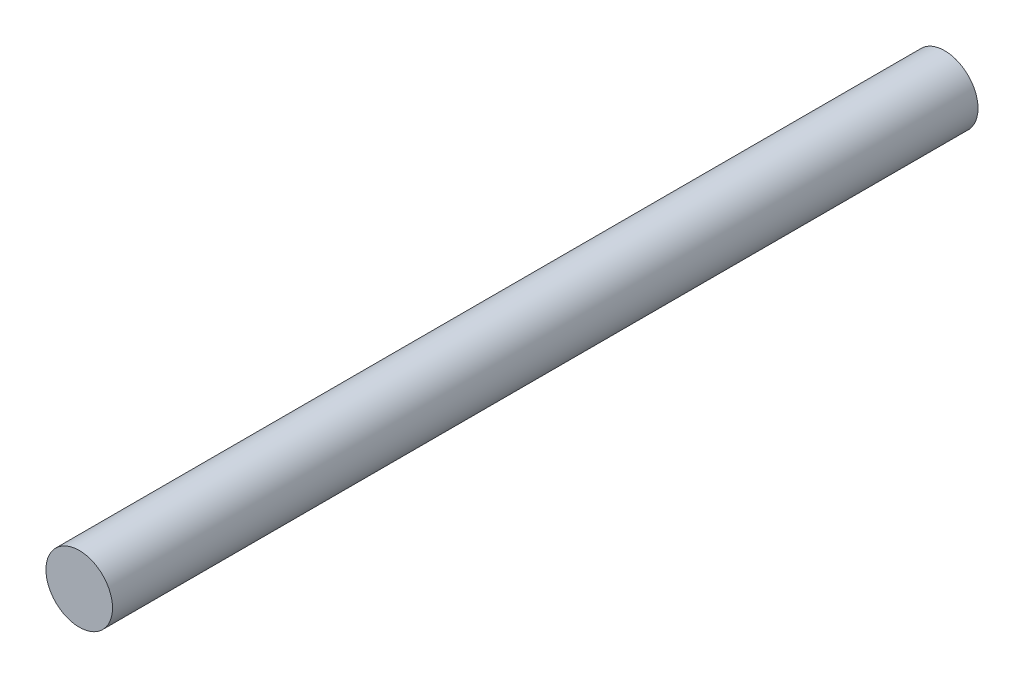
ISO-10303-21;
HEADER;
FILE_DESCRIPTION(('STEP AP214'),'2;1');
FILE_NAME('part.step','',(''),(''),'','','');
FILE_SCHEMA(('AUTOMOTIVE_DESIGN { 1 0 10303 214 1 1 1 1 }'));
ENDSEC;
DATA;
#1=APPLICATION_CONTEXT('core data for automotive mechanical design processes');
#2=APPLICATION_PROTOCOL_DEFINITION('international standard','automotive_design',2000,#1);
#3=PRODUCT_CONTEXT('',#1,'mechanical');
#4=PRODUCT('Part','Part','',(#3));
#5=PRODUCT_RELATED_PRODUCT_CATEGORY('part','',(#4));
#6=PRODUCT_DEFINITION_FORMATION('','',#4);
#7=PRODUCT_DEFINITION_CONTEXT('part definition',#1,'design');
#8=PRODUCT_DEFINITION('design','',#6,#7);
#9=PRODUCT_DEFINITION_SHAPE('','',#8);
#10=(LENGTH_UNIT() NAMED_UNIT(*) SI_UNIT(.MILLI.,.METRE.));
#11=(NAMED_UNIT(*) PLANE_ANGLE_UNIT() SI_UNIT($,.RADIAN.));
#12=(NAMED_UNIT(*) SI_UNIT($,.STERADIAN.) SOLID_ANGLE_UNIT());
#13=UNCERTAINTY_MEASURE_WITH_UNIT(LENGTH_MEASURE(1.E-05),#10,'distance_accuracy_value','');
#14=(GEOMETRIC_REPRESENTATION_CONTEXT(3) GLOBAL_UNCERTAINTY_ASSIGNED_CONTEXT((#13)) GLOBAL_UNIT_ASSIGNED_CONTEXT((#10,
#11,#12)) REPRESENTATION_CONTEXT('',''));
#15=CARTESIAN_POINT('',(0.,0.,0.));
#16=DIRECTION('',(0.,0.,1.));
#17=DIRECTION('',(1.,0.,0.));
#18=AXIS2_PLACEMENT_3D('',#15,#16,#17);
#19=CARTESIAN_POINT('',(0.,0.,82.55));
#20=DIRECTION('',(0.,0.,-1.));
#21=DIRECTION('',(-1.,0.,0.));
#22=AXIS2_PLACEMENT_3D('',#19,#20,#21);
#23=CYLINDRICAL_SURFACE('',#22,6.35);
#24=CARTESIAN_POINT('',(0.,0.,82.55));
#25=DIRECTION('',(0.,0.,1.));
#26=DIRECTION('',(1.,0.,0.));
#27=AXIS2_PLACEMENT_3D('',#24,#25,#26);
#28=CIRCLE('',#27,6.35);
#29=CARTESIAN_POINT('',(6.35,0.,82.55));
#30=VERTEX_POINT('',#29);
#31=EDGE_CURVE('E10',#30,#30,#28,.T.);
#32=ORIENTED_EDGE('',*,*,#31,.F.);
#33=EDGE_LOOP('',(#32));
#34=FACE_BOUND('',#33,.T.);
#35=CARTESIAN_POINT('',(0.,0.,-82.55));
#36=DIRECTION('',(0.,0.,1.));
#37=DIRECTION('',(1.,0.,0.));
#38=AXIS2_PLACEMENT_3D('',#35,#36,#37);
#39=CIRCLE('',#38,6.35);
#40=CARTESIAN_POINT('',(6.35,0.,-82.55));
#41=VERTEX_POINT('',#40);
#42=EDGE_CURVE('E37',#41,#41,#39,.T.);
#43=ORIENTED_EDGE('',*,*,#42,.T.);
#44=EDGE_LOOP('',(#43));
#45=FACE_BOUND('',#44,.T.);
#46=ADVANCED_FACE('F34',(#34,#45),#23,.T.);
#47=CARTESIAN_POINT('',(0.,0.,82.55));
#48=DIRECTION('',(0.,0.,1.));
#49=DIRECTION('',(1.,0.,0.));
#50=AXIS2_PLACEMENT_3D('',#47,#48,#49);
#51=PLANE('',#50);
#52=ORIENTED_EDGE('',*,*,#31,.T.);
#53=EDGE_LOOP('',(#52));
#54=FACE_BOUND('',#53,.T.);
#55=ADVANCED_FACE('F49',(#54),#51,.T.);
#56=CARTESIAN_POINT('',(0.,0.,-82.55));
#57=DIRECTION('',(0.,0.,1.));
#58=DIRECTION('',(1.,0.,0.));
#59=AXIS2_PLACEMENT_3D('',#56,#57,#58);
#60=PLANE('',#59);
#61=ORIENTED_EDGE('',*,*,#42,.F.);
#62=EDGE_LOOP('',(#61));
#63=FACE_BOUND('',#62,.T.);
#64=ADVANCED_FACE('F47',(#63),#60,.F.);
#65=CLOSED_SHELL('',(#46,#55,#64));
#66=MANIFOLD_SOLID_BREP('B2',#65);
#67=ADVANCED_BREP_SHAPE_REPRESENTATION('',(#18,#66),#14);
#68=SHAPE_DEFINITION_REPRESENTATION(#9,#67);
ENDSEC;
END-ISO-10303-21;
